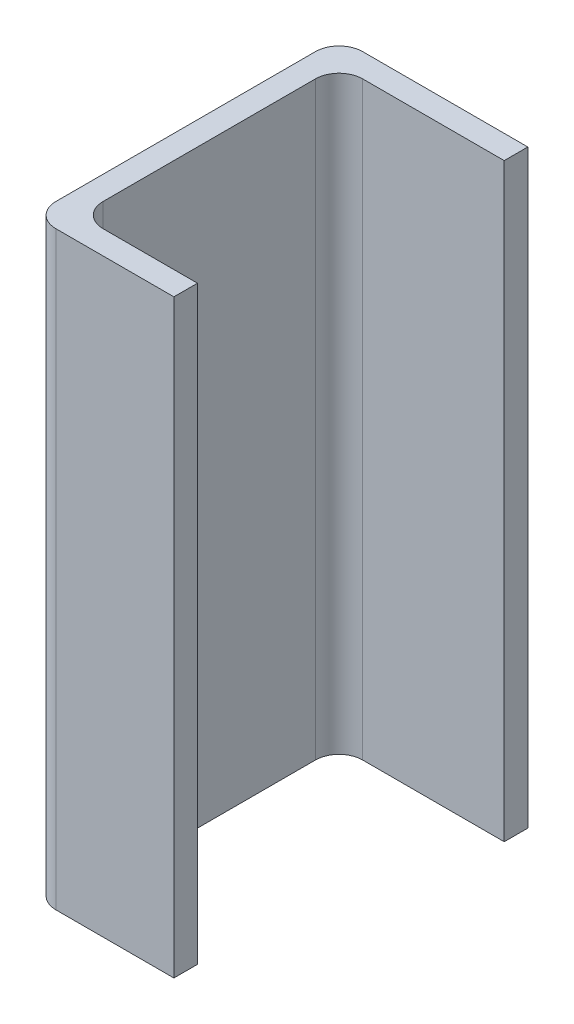
ISO-10303-21;
HEADER;
FILE_DESCRIPTION(('STEP AP214'),'2;1');
FILE_NAME('part.step','',(''),(''),'','','');
FILE_SCHEMA(('AUTOMOTIVE_DESIGN { 1 0 10303 214 1 1 1 1 }'));
ENDSEC;
DATA;
#1=APPLICATION_CONTEXT('core data for automotive mechanical design processes');
#2=APPLICATION_PROTOCOL_DEFINITION('international standard','automotive_design',2000,#1);
#3=PRODUCT_CONTEXT('',#1,'mechanical');
#4=PRODUCT('Part','Part','',(#3));
#5=PRODUCT_RELATED_PRODUCT_CATEGORY('part','',(#4));
#6=PRODUCT_DEFINITION_FORMATION('','',#4);
#7=PRODUCT_DEFINITION_CONTEXT('part definition',#1,'design');
#8=PRODUCT_DEFINITION('design','',#6,#7);
#9=PRODUCT_DEFINITION_SHAPE('','',#8);
#10=(LENGTH_UNIT() NAMED_UNIT(*) SI_UNIT(.MILLI.,.METRE.));
#11=(NAMED_UNIT(*) PLANE_ANGLE_UNIT() SI_UNIT($,.RADIAN.));
#12=(NAMED_UNIT(*) SI_UNIT($,.STERADIAN.) SOLID_ANGLE_UNIT());
#13=UNCERTAINTY_MEASURE_WITH_UNIT(LENGTH_MEASURE(1.E-05),#10,'distance_accuracy_value','');
#14=(GEOMETRIC_REPRESENTATION_CONTEXT(3) GLOBAL_UNCERTAINTY_ASSIGNED_CONTEXT((#13)) GLOBAL_UNIT_ASSIGNED_CONTEXT((#10,
#11,#12)) REPRESENTATION_CONTEXT('',''));
#15=CARTESIAN_POINT('',(0.,0.,0.));
#16=DIRECTION('',(0.,0.,1.));
#17=DIRECTION('',(1.,0.,0.));
#18=AXIS2_PLACEMENT_3D('',#15,#16,#17);
#19=CARTESIAN_POINT('',(-0.9,0.625,0.55));
#20=DIRECTION('',(0.,-1.,0.));
#21=DIRECTION('',(-0.707106781186548,0.,0.707106781186548));
#22=AXIS2_PLACEMENT_3D('',#19,#20,#21);
#23=CYLINDRICAL_SURFACE('',#22,0.05);
#24=CARTESIAN_POINT('',(-0.9,0.625,0.55));
#25=DIRECTION('',(0.,1.,0.));
#26=DIRECTION('',(-1.,0.,0.));
#27=AXIS2_PLACEMENT_3D('',#24,#25,#26);
#28=CIRCLE('',#27,0.05);
#29=CARTESIAN_POINT('',(-0.95,0.625,0.55));
#30=VERTEX_POINT('',#29);
#31=CARTESIAN_POINT('',(-0.9,0.625,0.6));
#32=VERTEX_POINT('',#31);
#33=EDGE_CURVE('E11',#30,#32,#28,.T.);
#34=ORIENTED_EDGE('',*,*,#33,.T.);
#35=DIRECTION('',(0.,-1.,0.));
#36=VECTOR('',#35,1.);
#37=CARTESIAN_POINT('',(-0.9,0.625,0.6));
#38=LINE('',#37,#36);
#39=CARTESIAN_POINT('',(-0.9,-0.625,0.6));
#40=VERTEX_POINT('',#39);
#41=EDGE_CURVE('E24',#32,#40,#38,.T.);
#42=ORIENTED_EDGE('',*,*,#41,.T.);
#43=CARTESIAN_POINT('',(-0.9,-0.625,0.55));
#44=DIRECTION('',(0.,-1.,0.));
#45=DIRECTION('',(0.,0.,1.));
#46=AXIS2_PLACEMENT_3D('',#43,#44,#45);
#47=CIRCLE('',#46,0.05);
#48=CARTESIAN_POINT('',(-0.95,-0.625,0.55));
#49=VERTEX_POINT('',#48);
#50=EDGE_CURVE('E192',#40,#49,#47,.T.);
#51=ORIENTED_EDGE('',*,*,#50,.T.);
#52=DIRECTION('',(0.,1.,0.));
#53=VECTOR('',#52,1.);
#54=CARTESIAN_POINT('',(-0.95,-0.625,0.55));
#55=LINE('',#54,#53);
#56=EDGE_CURVE('E183',#49,#30,#55,.T.);
#57=ORIENTED_EDGE('',*,*,#56,.T.);
#58=EDGE_LOOP('',(#34,#42,#51,#57));
#59=FACE_BOUND('',#58,.T.);
#60=ADVANCED_FACE('F17',(#59),#23,.F.);
#61=CARTESIAN_POINT('',(-0.95,0.625,0.6));
#62=DIRECTION('',(0.,0.,1.));
#63=DIRECTION('',(1.,0.,0.));
#64=AXIS2_PLACEMENT_3D('',#61,#62,#63);
#65=PLANE('',#64);
#66=ORIENTED_EDGE('',*,*,#41,.F.);
#67=DIRECTION('',(-1.,0.,0.));
#68=VECTOR('',#67,1.);
#69=CARTESIAN_POINT('',(-0.7,0.625,0.6));
#70=LINE('',#69,#68);
#71=CARTESIAN_POINT('',(-0.7,0.625,0.6));
#72=VERTEX_POINT('',#71);
#73=EDGE_CURVE('E194',#72,#32,#70,.T.);
#74=ORIENTED_EDGE('',*,*,#73,.F.);
#75=DIRECTION('',(0.,1.,0.));
#76=VECTOR('',#75,1.);
#77=CARTESIAN_POINT('',(-0.7,-0.625,0.6));
#78=LINE('',#77,#76);
#79=CARTESIAN_POINT('',(-0.7,-0.625,0.6));
#80=VERTEX_POINT('',#79);
#81=EDGE_CURVE('E185',#80,#72,#78,.T.);
#82=ORIENTED_EDGE('',*,*,#81,.F.);
#83=DIRECTION('',(1.,0.,0.));
#84=VECTOR('',#83,1.);
#85=CARTESIAN_POINT('',(-0.9,-0.625,0.6));
#86=LINE('',#85,#84);
#87=EDGE_CURVE('E174',#40,#80,#86,.T.);
#88=ORIENTED_EDGE('',*,*,#87,.F.);
#89=EDGE_LOOP('',(#66,#74,#82,#88));
#90=FACE_BOUND('',#89,.T.);
#91=ADVANCED_FACE('F235',(#90),#65,.F.);
#92=CARTESIAN_POINT('',(-0.95,0.3125,0.6));
#93=DIRECTION('',(0.,-1.,0.));
#94=DIRECTION('',(-0.707106781186548,0.,0.707106781186548));
#95=AXIS2_PLACEMENT_3D('',#92,#93,#94);
#96=CYLINDRICAL_SURFACE('',#95,0.05);
#97=CARTESIAN_POINT('',(-0.95,-0.625,0.6));
#98=DIRECTION('',(0.,1.,0.));
#99=DIRECTION('',(-1.,0.,0.));
#100=AXIS2_PLACEMENT_3D('',#97,#98,#99);
#101=CIRCLE('',#100,0.05);
#102=CARTESIAN_POINT('',(-1.,-0.625,0.6));
#103=VERTEX_POINT('',#102);
#104=CARTESIAN_POINT('',(-0.95,-0.625,0.65));
#105=VERTEX_POINT('',#104);
#106=EDGE_CURVE('E197',#103,#105,#101,.T.);
#107=ORIENTED_EDGE('',*,*,#106,.T.);
#108=DIRECTION('',(0.,1.,0.));
#109=VECTOR('',#108,1.);
#110=CARTESIAN_POINT('',(-0.95,-0.625,0.65));
#111=LINE('',#110,#109);
#112=CARTESIAN_POINT('',(-0.95,0.625,0.65));
#113=VERTEX_POINT('',#112);
#114=EDGE_CURVE('E188',#105,#113,#111,.T.);
#115=ORIENTED_EDGE('',*,*,#114,.T.);
#116=CARTESIAN_POINT('',(-0.95,0.625,0.6));
#117=DIRECTION('',(0.,-1.,0.));
#118=DIRECTION('',(0.,0.,1.));
#119=AXIS2_PLACEMENT_3D('',#116,#117,#118);
#120=CIRCLE('',#119,0.05);
#121=CARTESIAN_POINT('',(-1.,0.625,0.6));
#122=VERTEX_POINT('',#121);
#123=EDGE_CURVE('E180',#113,#122,#120,.T.);
#124=ORIENTED_EDGE('',*,*,#123,.T.);
#125=DIRECTION('',(0.,-1.,0.));
#126=VECTOR('',#125,1.);
#127=CARTESIAN_POINT('',(-1.,0.625,0.6));
#128=LINE('',#127,#126);
#129=EDGE_CURVE('E190',#122,#103,#128,.T.);
#130=ORIENTED_EDGE('',*,*,#129,.T.);
#131=EDGE_LOOP('',(#107,#115,#124,#130));
#132=FACE_BOUND('',#131,.T.);
#133=ADVANCED_FACE('F200',(#132),#96,.T.);
#134=CARTESIAN_POINT('',(-1.,0.625,0.));
#135=DIRECTION('',(-1.,0.,0.));
#136=DIRECTION('',(0.,-1.,0.));
#137=AXIS2_PLACEMENT_3D('',#134,#135,#136);
#138=PLANE('',#137);
#139=ORIENTED_EDGE('',*,*,#129,.F.);
#140=DIRECTION('',(0.,0.,1.));
#141=VECTOR('',#140,1.);
#142=CARTESIAN_POINT('',(-1.,0.625,0.05));
#143=LINE('',#142,#141);
#144=CARTESIAN_POINT('',(-1.,0.625,0.05));
#145=VERTEX_POINT('',#144);
#146=EDGE_CURVE('E177',#145,#122,#143,.T.);
#147=ORIENTED_EDGE('',*,*,#146,.F.);
#148=DIRECTION('',(0.,1.,0.));
#149=VECTOR('',#148,1.);
#150=CARTESIAN_POINT('',(-1.,-0.625,0.05));
#151=LINE('',#150,#149);
#152=CARTESIAN_POINT('',(-1.,-0.625,0.05));
#153=VERTEX_POINT('',#152);
#154=EDGE_CURVE('E167',#153,#145,#151,.T.);
#155=ORIENTED_EDGE('',*,*,#154,.F.);
#156=DIRECTION('',(0.,0.,1.));
#157=VECTOR('',#156,1.);
#158=CARTESIAN_POINT('',(-1.,-0.625,0.05));
#159=LINE('',#158,#157);
#160=EDGE_CURVE('E159',#153,#103,#159,.T.);
#161=ORIENTED_EDGE('',*,*,#160,.T.);
#162=EDGE_LOOP('',(#139,#147,#155,#161));
#163=FACE_BOUND('',#162,.T.);
#164=ADVANCED_FACE('F216',(#163),#138,.T.);
#165=CARTESIAN_POINT('',(1.,0.625,0.));
#166=DIRECTION('',(0.,1.,0.));
#167=DIRECTION('',(-1.,0.,0.));
#168=AXIS2_PLACEMENT_3D('',#165,#166,#167);
#169=PLANE('',#168);
#170=ORIENTED_EDGE('',*,*,#123,.F.);
#171=DIRECTION('',(-1.,0.,0.));
#172=VECTOR('',#171,1.);
#173=CARTESIAN_POINT('',(-0.7,0.625,0.65));
#174=LINE('',#173,#172);
#175=CARTESIAN_POINT('',(-0.7,0.625,0.65));
#176=VERTEX_POINT('',#175);
#177=EDGE_CURVE('E170',#176,#113,#174,.T.);
#178=ORIENTED_EDGE('',*,*,#177,.F.);
#179=DIRECTION('',(0.,0.,-1.));
#180=VECTOR('',#179,1.);
#181=CARTESIAN_POINT('',(-0.7,0.625,0.65));
#182=LINE('',#181,#180);
#183=EDGE_CURVE('E162',#176,#72,#182,.T.);
#184=ORIENTED_EDGE('',*,*,#183,.T.);
#185=ORIENTED_EDGE('',*,*,#73,.T.);
#186=ORIENTED_EDGE('',*,*,#33,.F.);
#187=DIRECTION('',(0.,0.,-1.));
#188=VECTOR('',#187,1.);
#189=CARTESIAN_POINT('',(-0.95,0.625,0.55));
#190=LINE('',#189,#188);
#191=CARTESIAN_POINT('',(-0.95,0.625,0.1));
#192=VERTEX_POINT('',#191);
#193=EDGE_CURVE('E142',#30,#192,#190,.T.);
#194=ORIENTED_EDGE('',*,*,#193,.T.);
#195=CARTESIAN_POINT('',(-0.9,0.625,0.1));
#196=DIRECTION('',(0.,1.,0.));
#197=DIRECTION('',(0.,0.,-1.));
#198=AXIS2_PLACEMENT_3D('',#195,#196,#197);
#199=CIRCLE('',#198,0.05);
#200=CARTESIAN_POINT('',(-0.9,0.625,0.0500000000000002));
#201=VERTEX_POINT('',#200);
#202=EDGE_CURVE('E149',#201,#192,#199,.T.);
#203=ORIENTED_EDGE('',*,*,#202,.F.);
#204=DIRECTION('',(1.,0.,0.));
#205=VECTOR('',#204,1.);
#206=CARTESIAN_POINT('',(-0.9,0.625,0.0500000000000002));
#207=LINE('',#206,#205);
#208=CARTESIAN_POINT('',(-0.600017415079809,0.625,0.05));
#209=VERTEX_POINT('',#208);
#210=EDGE_CURVE('E113',#201,#209,#207,.T.);
#211=ORIENTED_EDGE('',*,*,#210,.T.);
#212=DIRECTION('',(0.,0.,-1.));
#213=VECTOR('',#212,1.);
#214=CARTESIAN_POINT('',(-0.600017415079809,0.625,0.05));
#215=LINE('',#214,#213);
#216=CARTESIAN_POINT('',(-0.600017415079809,0.625,0.));
#217=VERTEX_POINT('',#216);
#218=EDGE_CURVE('E128',#209,#217,#215,.T.);
#219=ORIENTED_EDGE('',*,*,#218,.T.);
#220=DIRECTION('',(-1.,0.,0.));
#221=VECTOR('',#220,1.);
#222=CARTESIAN_POINT('',(-0.600017415079809,0.625,0.));
#223=LINE('',#222,#221);
#224=CARTESIAN_POINT('',(-0.95,0.625,0.));
#225=VERTEX_POINT('',#224);
#226=EDGE_CURVE('E108',#217,#225,#223,.T.);
#227=ORIENTED_EDGE('',*,*,#226,.T.);
#228=CARTESIAN_POINT('',(-0.95,0.625,0.05));
#229=DIRECTION('',(0.,-1.,0.));
#230=DIRECTION('',(-1.,0.,0.));
#231=AXIS2_PLACEMENT_3D('',#228,#229,#230);
#232=CIRCLE('',#231,0.05);
#233=EDGE_CURVE('E155',#145,#225,#232,.T.);
#234=ORIENTED_EDGE('',*,*,#233,.F.);
#235=ORIENTED_EDGE('',*,*,#146,.T.);
#236=EDGE_LOOP('',(#170,#178,#184,#185,#186,#194,#203,#211,#219,#227,#234,#235));
#237=FACE_BOUND('',#236,.T.);
#238=ADVANCED_FACE('F212',(#237),#169,.T.);
#239=CARTESIAN_POINT('',(-0.95,0.3125,0.05));
#240=DIRECTION('',(0.,-1.,0.));
#241=DIRECTION('',(-0.707106781186548,0.,-0.707106781186547));
#242=AXIS2_PLACEMENT_3D('',#239,#240,#241);
#243=CYLINDRICAL_SURFACE('',#242,0.05);
#244=CARTESIAN_POINT('',(-0.95,-0.625,0.05));
#245=DIRECTION('',(0.,1.,0.));
#246=DIRECTION('',(0.,0.,-1.));
#247=AXIS2_PLACEMENT_3D('',#244,#245,#246);
#248=CIRCLE('',#247,0.05);
#249=CARTESIAN_POINT('',(-0.95,-0.625,0.));
#250=VERTEX_POINT('',#249);
#251=EDGE_CURVE('E127',#250,#153,#248,.T.);
#252=ORIENTED_EDGE('',*,*,#251,.T.);
#253=ORIENTED_EDGE('',*,*,#154,.T.);
#254=ORIENTED_EDGE('',*,*,#233,.T.);
#255=DIRECTION('',(0.,-1.,0.));
#256=VECTOR('',#255,1.);
#257=CARTESIAN_POINT('',(-0.95,0.625,0.));
#258=LINE('',#257,#256);
#259=EDGE_CURVE('E153',#225,#250,#258,.T.);
#260=ORIENTED_EDGE('',*,*,#259,.T.);
#261=EDGE_LOOP('',(#252,#253,#254,#260));
#262=FACE_BOUND('',#261,.T.);
#263=ADVANCED_FACE('F218',(#262),#243,.T.);
#264=CARTESIAN_POINT('',(-0.9,0.625,0.1));
#265=DIRECTION('',(0.,1.,0.));
#266=DIRECTION('',(-0.707106781186548,0.,-0.707106781186547));
#267=AXIS2_PLACEMENT_3D('',#264,#265,#266);
#268=CYLINDRICAL_SURFACE('',#267,0.05);
#269=CARTESIAN_POINT('',(-0.9,-0.625,0.1));
#270=DIRECTION('',(0.,-1.,0.));
#271=DIRECTION('',(-1.,0.,0.));
#272=AXIS2_PLACEMENT_3D('',#269,#270,#271);
#273=CIRCLE('',#272,0.05);
#274=CARTESIAN_POINT('',(-0.95,-0.625,0.1));
#275=VERTEX_POINT('',#274);
#276=CARTESIAN_POINT('',(-0.9,-0.625,0.0500000000000002));
#277=VERTEX_POINT('',#276);
#278=EDGE_CURVE('E165',#275,#277,#273,.T.);
#279=ORIENTED_EDGE('',*,*,#278,.T.);
#280=DIRECTION('',(0.,1.,0.));
#281=VECTOR('',#280,1.);
#282=CARTESIAN_POINT('',(-0.9,-0.625,0.0500000000000002));
#283=LINE('',#282,#281);
#284=EDGE_CURVE('E157',#277,#201,#283,.T.);
#285=ORIENTED_EDGE('',*,*,#284,.T.);
#286=ORIENTED_EDGE('',*,*,#202,.T.);
#287=DIRECTION('',(0.,-1.,0.));
#288=VECTOR('',#287,1.);
#289=CARTESIAN_POINT('',(-0.95,0.625,0.1));
#290=LINE('',#289,#288);
#291=EDGE_CURVE('E145',#192,#275,#290,.T.);
#292=ORIENTED_EDGE('',*,*,#291,.T.);
#293=EDGE_LOOP('',(#279,#285,#286,#292));
#294=FACE_BOUND('',#293,.T.);
#295=ADVANCED_FACE('F228',(#294),#268,.F.);
#296=CARTESIAN_POINT('',(0.95,0.625,0.0499999999999998));
#297=DIRECTION('',(0.,0.,-1.));
#298=DIRECTION('',(-1.,0.,0.));
#299=AXIS2_PLACEMENT_3D('',#296,#297,#298);
#300=PLANE('',#299);
#301=ORIENTED_EDGE('',*,*,#284,.F.);
#302=DIRECTION('',(-1.,0.,0.));
#303=VECTOR('',#302,1.);
#304=CARTESIAN_POINT('',(-0.600017415079809,-0.625,0.0500000000000001));
#305=LINE('',#304,#303);
#306=CARTESIAN_POINT('',(-0.600017415079809,-0.625,0.05));
#307=VERTEX_POINT('',#306);
#308=EDGE_CURVE('E151',#307,#277,#305,.T.);
#309=ORIENTED_EDGE('',*,*,#308,.F.);
#310=DIRECTION('',(0.,-1.,0.));
#311=VECTOR('',#310,1.);
#312=CARTESIAN_POINT('',(-0.600017415079809,0.625,0.05));
#313=LINE('',#312,#311);
#314=EDGE_CURVE('E119',#209,#307,#313,.T.);
#315=ORIENTED_EDGE('',*,*,#314,.F.);
#316=ORIENTED_EDGE('',*,*,#210,.F.);
#317=EDGE_LOOP('',(#301,#309,#315,#316));
#318=FACE_BOUND('',#317,.T.);
#319=ADVANCED_FACE('F223',(#318),#300,.F.);
#320=CARTESIAN_POINT('',(0.,0.,0.));
#321=DIRECTION('',(0.,0.,1.));
#322=DIRECTION('',(1.,0.,0.));
#323=AXIS2_PLACEMENT_3D('',#320,#321,#322);
#324=PLANE('',#323);
#325=ORIENTED_EDGE('',*,*,#259,.F.);
#326=ORIENTED_EDGE('',*,*,#226,.F.);
#327=DIRECTION('',(0.,-1.,0.));
#328=VECTOR('',#327,1.);
#329=CARTESIAN_POINT('',(-0.600017415079809,0.625,0.));
#330=LINE('',#329,#328);
#331=CARTESIAN_POINT('',(-0.600017415079809,-0.625,0.));
#332=VERTEX_POINT('',#331);
#333=EDGE_CURVE('E100',#217,#332,#330,.T.);
#334=ORIENTED_EDGE('',*,*,#333,.T.);
#335=DIRECTION('',(1.,0.,0.));
#336=VECTOR('',#335,1.);
#337=CARTESIAN_POINT('',(-0.95,-0.625,0.));
#338=LINE('',#337,#336);
#339=EDGE_CURVE('E105',#250,#332,#338,.T.);
#340=ORIENTED_EDGE('',*,*,#339,.F.);
#341=EDGE_LOOP('',(#325,#326,#334,#340));
#342=FACE_BOUND('',#341,.T.);
#343=ADVANCED_FACE('F103',(#342),#324,.F.);
#344=CARTESIAN_POINT('',(0.,0.,0.65));
#345=DIRECTION('',(0.,0.,1.));
#346=DIRECTION('',(1.,0.,0.));
#347=AXIS2_PLACEMENT_3D('',#344,#345,#346);
#348=PLANE('',#347);
#349=ORIENTED_EDGE('',*,*,#114,.F.);
#350=DIRECTION('',(1.,0.,0.));
#351=VECTOR('',#350,1.);
#352=CARTESIAN_POINT('',(-0.95,-0.625,0.65));
#353=LINE('',#352,#351);
#354=CARTESIAN_POINT('',(-0.7,-0.625,0.65));
#355=VERTEX_POINT('',#354);
#356=EDGE_CURVE('E112',#105,#355,#353,.T.);
#357=ORIENTED_EDGE('',*,*,#356,.T.);
#358=DIRECTION('',(0.,1.,0.));
#359=VECTOR('',#358,1.);
#360=CARTESIAN_POINT('',(-0.7,-0.625,0.65));
#361=LINE('',#360,#359);
#362=EDGE_CURVE('E122',#355,#176,#361,.T.);
#363=ORIENTED_EDGE('',*,*,#362,.T.);
#364=ORIENTED_EDGE('',*,*,#177,.T.);
#365=EDGE_LOOP('',(#349,#357,#363,#364));
#366=FACE_BOUND('',#365,.T.);
#367=ADVANCED_FACE('F204',(#366),#348,.T.);
#368=CARTESIAN_POINT('',(-0.7,-1.69885678434986,0.65));
#369=DIRECTION('',(-1.,0.,0.));
#370=DIRECTION('',(0.,1.,0.));
#371=AXIS2_PLACEMENT_3D('',#368,#369,#370);
#372=PLANE('',#371);
#373=DIRECTION('',(0.,0.,1.));
#374=VECTOR('',#373,1.);
#375=CARTESIAN_POINT('',(-0.7,-0.625,0.6));
#376=LINE('',#375,#374);
#377=EDGE_CURVE('E139',#80,#355,#376,.T.);
#378=ORIENTED_EDGE('',*,*,#377,.F.);
#379=ORIENTED_EDGE('',*,*,#81,.T.);
#380=ORIENTED_EDGE('',*,*,#183,.F.);
#381=ORIENTED_EDGE('',*,*,#362,.F.);
#382=EDGE_LOOP('',(#378,#379,#380,#381));
#383=FACE_BOUND('',#382,.T.);
#384=ADVANCED_FACE('F209',(#383),#372,.F.);
#385=CARTESIAN_POINT('',(-0.600017415079809,0.84306281813489,0.));
#386=DIRECTION('',(-1.,0.,0.));
#387=DIRECTION('',(0.,-1.,0.));
#388=AXIS2_PLACEMENT_3D('',#385,#386,#387);
#389=PLANE('',#388);
#390=DIRECTION('',(0.,0.,1.));
#391=VECTOR('',#390,1.);
#392=CARTESIAN_POINT('',(-0.600017415079809,-0.625,0.));
#393=LINE('',#392,#391);
#394=EDGE_CURVE('E117',#332,#307,#393,.T.);
#395=ORIENTED_EDGE('',*,*,#394,.F.);
#396=ORIENTED_EDGE('',*,*,#333,.F.);
#397=ORIENTED_EDGE('',*,*,#218,.F.);
#398=ORIENTED_EDGE('',*,*,#314,.T.);
#399=EDGE_LOOP('',(#395,#396,#397,#398));
#400=FACE_BOUND('',#399,.T.);
#401=ADVANCED_FACE('F118',(#400),#389,.F.);
#402=CARTESIAN_POINT('',(-1.,-0.625,0.));
#403=DIRECTION('',(0.,-1.,0.));
#404=DIRECTION('',(1.,0.,0.));
#405=AXIS2_PLACEMENT_3D('',#402,#403,#404);
#406=PLANE('',#405);
#407=ORIENTED_EDGE('',*,*,#106,.F.);
#408=ORIENTED_EDGE('',*,*,#160,.F.);
#409=ORIENTED_EDGE('',*,*,#251,.F.);
#410=ORIENTED_EDGE('',*,*,#339,.T.);
#411=ORIENTED_EDGE('',*,*,#394,.T.);
#412=ORIENTED_EDGE('',*,*,#308,.T.);
#413=ORIENTED_EDGE('',*,*,#278,.F.);
#414=DIRECTION('',(0.,0.,1.));
#415=VECTOR('',#414,1.);
#416=CARTESIAN_POINT('',(-0.95,-0.625,0.1));
#417=LINE('',#416,#415);
#418=EDGE_CURVE('E132',#275,#49,#417,.T.);
#419=ORIENTED_EDGE('',*,*,#418,.T.);
#420=ORIENTED_EDGE('',*,*,#50,.F.);
#421=ORIENTED_EDGE('',*,*,#87,.T.);
#422=ORIENTED_EDGE('',*,*,#377,.T.);
#423=ORIENTED_EDGE('',*,*,#356,.F.);
#424=EDGE_LOOP('',(#407,#408,#409,#410,#411,#412,#413,#419,#420,#421,#422,#423));
#425=FACE_BOUND('',#424,.T.);
#426=ADVANCED_FACE('F125',(#425),#406,.T.);
#427=CARTESIAN_POINT('',(-0.95,0.625,0.0500000000000002));
#428=DIRECTION('',(-1.,0.,0.));
#429=DIRECTION('',(0.,0.,1.));
#430=AXIS2_PLACEMENT_3D('',#427,#428,#429);
#431=PLANE('',#430);
#432=ORIENTED_EDGE('',*,*,#56,.F.);
#433=ORIENTED_EDGE('',*,*,#418,.F.);
#434=ORIENTED_EDGE('',*,*,#291,.F.);
#435=ORIENTED_EDGE('',*,*,#193,.F.);
#436=EDGE_LOOP('',(#432,#433,#434,#435));
#437=FACE_BOUND('',#436,.T.);
#438=ADVANCED_FACE('F233',(#437),#431,.F.);
#439=CLOSED_SHELL('',(#60,#91,#133,#164,#238,#263,#295,#319,#343,#367,#384,#401,#426,#438));
#440=MANIFOLD_SOLID_BREP('B1',#439);
#441=ADVANCED_BREP_SHAPE_REPRESENTATION('',(#18,#440),#14);
#442=SHAPE_DEFINITION_REPRESENTATION(#9,#441);
ENDSEC;
END-ISO-10303-21;
